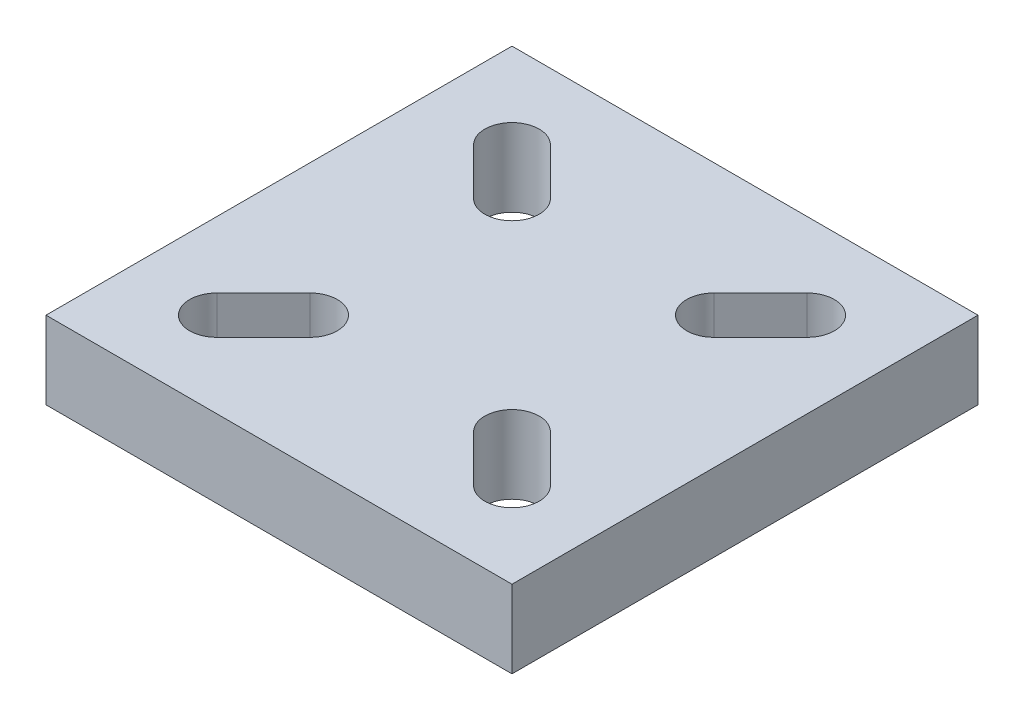
ISO-10303-21;
HEADER;
FILE_DESCRIPTION(('STEP AP214'),'2;1');
FILE_NAME('part.step','',(''),(''),'','','');
FILE_SCHEMA(('AUTOMOTIVE_DESIGN { 1 0 10303 214 1 1 1 1 }'));
ENDSEC;
DATA;
#1=APPLICATION_CONTEXT('core data for automotive mechanical design processes');
#2=APPLICATION_PROTOCOL_DEFINITION('international standard','automotive_design',2000,#1);
#3=PRODUCT_CONTEXT('',#1,'mechanical');
#4=PRODUCT('Part','Part','',(#3));
#5=PRODUCT_RELATED_PRODUCT_CATEGORY('part','',(#4));
#6=PRODUCT_DEFINITION_FORMATION('','',#4);
#7=PRODUCT_DEFINITION_CONTEXT('part definition',#1,'design');
#8=PRODUCT_DEFINITION('design','',#6,#7);
#9=PRODUCT_DEFINITION_SHAPE('','',#8);
#10=(LENGTH_UNIT() NAMED_UNIT(*) SI_UNIT(.MILLI.,.METRE.));
#11=(NAMED_UNIT(*) PLANE_ANGLE_UNIT() SI_UNIT($,.RADIAN.));
#12=(NAMED_UNIT(*) SI_UNIT($,.STERADIAN.) SOLID_ANGLE_UNIT());
#13=UNCERTAINTY_MEASURE_WITH_UNIT(LENGTH_MEASURE(1.E-05),#10,'distance_accuracy_value','');
#14=(GEOMETRIC_REPRESENTATION_CONTEXT(3) GLOBAL_UNCERTAINTY_ASSIGNED_CONTEXT((#13)) GLOBAL_UNIT_ASSIGNED_CONTEXT((#10,
#11,#12)) REPRESENTATION_CONTEXT('',''));
#15=CARTESIAN_POINT('',(0.,0.,0.));
#16=DIRECTION('',(0.,0.,1.));
#17=DIRECTION('',(1.,0.,0.));
#18=AXIS2_PLACEMENT_3D('',#15,#16,#17);
#19=CARTESIAN_POINT('',(30.,10.,-30.));
#20=DIRECTION('',(1.,0.,0.));
#21=DIRECTION('',(0.,0.,-1.));
#22=AXIS2_PLACEMENT_3D('',#19,#20,#21);
#23=PLANE('',#22);
#24=DIRECTION('',(0.,0.,1.));
#25=VECTOR('',#24,1.);
#26=CARTESIAN_POINT('',(30.,0.,-30.));
#27=LINE('',#26,#25);
#28=CARTESIAN_POINT('',(30.,0.,-30.));
#29=VERTEX_POINT('',#28);
#30=CARTESIAN_POINT('',(30.,0.,30.));
#31=VERTEX_POINT('',#30);
#32=EDGE_CURVE('E299',#29,#31,#27,.T.);
#33=ORIENTED_EDGE('',*,*,#32,.F.);
#34=DIRECTION('',(0.,-1.,0.));
#35=VECTOR('',#34,1.);
#36=CARTESIAN_POINT('',(30.,10.,-30.));
#37=LINE('',#36,#35);
#38=CARTESIAN_POINT('',(30.,10.,-30.));
#39=VERTEX_POINT('',#38);
#40=EDGE_CURVE('E11',#39,#29,#37,.T.);
#41=ORIENTED_EDGE('',*,*,#40,.F.);
#42=DIRECTION('',(0.,0.,1.));
#43=VECTOR('',#42,1.);
#44=CARTESIAN_POINT('',(30.,10.,-30.));
#45=LINE('',#44,#43);
#46=CARTESIAN_POINT('',(30.,10.,30.));
#47=VERTEX_POINT('',#46);
#48=EDGE_CURVE('E306',#39,#47,#45,.T.);
#49=ORIENTED_EDGE('',*,*,#48,.T.);
#50=DIRECTION('',(0.,-1.,0.));
#51=VECTOR('',#50,1.);
#52=CARTESIAN_POINT('',(30.,10.,30.));
#53=LINE('',#52,#51);
#54=EDGE_CURVE('E36',#47,#31,#53,.T.);
#55=ORIENTED_EDGE('',*,*,#54,.T.);
#56=EDGE_LOOP('',(#33,#41,#49,#55));
#57=FACE_BOUND('',#56,.T.);
#58=ADVANCED_FACE('F33',(#57),#23,.T.);
#59=CARTESIAN_POINT('',(30.,10.,-30.));
#60=DIRECTION('',(0.,0.,1.));
#61=DIRECTION('',(1.,0.,0.));
#62=AXIS2_PLACEMENT_3D('',#59,#60,#61);
#63=PLANE('',#62);
#64=DIRECTION('',(-1.,0.,0.));
#65=VECTOR('',#64,1.);
#66=CARTESIAN_POINT('',(30.,0.,-30.));
#67=LINE('',#66,#65);
#68=CARTESIAN_POINT('',(-30.,0.,-30.));
#69=VERTEX_POINT('',#68);
#70=EDGE_CURVE('E310',#29,#69,#67,.T.);
#71=ORIENTED_EDGE('',*,*,#70,.T.);
#72=DIRECTION('',(0.,-1.,0.));
#73=VECTOR('',#72,1.);
#74=CARTESIAN_POINT('',(-30.,10.,-30.));
#75=LINE('',#74,#73);
#76=CARTESIAN_POINT('',(-30.,10.,-30.));
#77=VERTEX_POINT('',#76);
#78=EDGE_CURVE('E41',#77,#69,#75,.T.);
#79=ORIENTED_EDGE('',*,*,#78,.F.);
#80=DIRECTION('',(-1.,0.,0.));
#81=VECTOR('',#80,1.);
#82=CARTESIAN_POINT('',(30.,10.,-30.));
#83=LINE('',#82,#81);
#84=EDGE_CURVE('E315',#39,#77,#83,.T.);
#85=ORIENTED_EDGE('',*,*,#84,.F.);
#86=ORIENTED_EDGE('',*,*,#40,.T.);
#87=EDGE_LOOP('',(#71,#79,#85,#86));
#88=FACE_BOUND('',#87,.T.);
#89=ADVANCED_FACE('F341',(#88),#63,.F.);
#90=CARTESIAN_POINT('',(-30.,10.,-30.));
#91=DIRECTION('',(1.,0.,0.));
#92=DIRECTION('',(0.,0.,-1.));
#93=AXIS2_PLACEMENT_3D('',#90,#91,#92);
#94=PLANE('',#93);
#95=DIRECTION('',(0.,0.,1.));
#96=VECTOR('',#95,1.);
#97=CARTESIAN_POINT('',(-30.,0.,-30.));
#98=LINE('',#97,#96);
#99=CARTESIAN_POINT('',(-30.,0.,30.));
#100=VERTEX_POINT('',#99);
#101=EDGE_CURVE('E322',#69,#100,#98,.T.);
#102=ORIENTED_EDGE('',*,*,#101,.T.);
#103=DIRECTION('',(0.,-1.,0.));
#104=VECTOR('',#103,1.);
#105=CARTESIAN_POINT('',(-30.,10.,30.));
#106=LINE('',#105,#104);
#107=CARTESIAN_POINT('',(-30.,10.,30.));
#108=VERTEX_POINT('',#107);
#109=EDGE_CURVE('E327',#108,#100,#106,.T.);
#110=ORIENTED_EDGE('',*,*,#109,.F.);
#111=DIRECTION('',(0.,0.,1.));
#112=VECTOR('',#111,1.);
#113=CARTESIAN_POINT('',(-30.,10.,-30.));
#114=LINE('',#113,#112);
#115=EDGE_CURVE('E313',#77,#108,#114,.T.);
#116=ORIENTED_EDGE('',*,*,#115,.F.);
#117=ORIENTED_EDGE('',*,*,#78,.T.);
#118=EDGE_LOOP('',(#102,#110,#116,#117));
#119=FACE_BOUND('',#118,.T.);
#120=ADVANCED_FACE('F345',(#119),#94,.F.);
#121=CARTESIAN_POINT('',(30.,10.,30.));
#122=DIRECTION('',(0.,0.,1.));
#123=DIRECTION('',(1.,0.,0.));
#124=AXIS2_PLACEMENT_3D('',#121,#122,#123);
#125=PLANE('',#124);
#126=DIRECTION('',(-1.,0.,0.));
#127=VECTOR('',#126,1.);
#128=CARTESIAN_POINT('',(30.,0.,30.));
#129=LINE('',#128,#127);
#130=EDGE_CURVE('E319',#31,#100,#129,.T.);
#131=ORIENTED_EDGE('',*,*,#130,.F.);
#132=ORIENTED_EDGE('',*,*,#54,.F.);
#133=DIRECTION('',(-1.,0.,0.));
#134=VECTOR('',#133,1.);
#135=CARTESIAN_POINT('',(30.,10.,30.));
#136=LINE('',#135,#134);
#137=EDGE_CURVE('E309',#47,#108,#136,.T.);
#138=ORIENTED_EDGE('',*,*,#137,.T.);
#139=ORIENTED_EDGE('',*,*,#109,.T.);
#140=EDGE_LOOP('',(#131,#132,#138,#139));
#141=FACE_BOUND('',#140,.T.);
#142=ADVANCED_FACE('F335',(#141),#125,.T.);
#143=CARTESIAN_POINT('',(0.,10.,0.));
#144=DIRECTION('',(0.,-1.,0.));
#145=DIRECTION('',(0.,0.,-1.));
#146=AXIS2_PLACEMENT_3D('',#143,#144,#145);
#147=PLANE('',#146);
#148=DIRECTION('',(0.707106781186543,0.,-0.707106781186552));
#149=VECTOR('',#148,1.);
#150=CARTESIAN_POINT('',(-16.5251262658468,10.,21.4748737341529));
#151=LINE('',#150,#149);
#152=CARTESIAN_POINT('',(-16.5251262658468,10.,21.4748737341529));
#153=VERTEX_POINT('',#152);
#154=CARTESIAN_POINT('',(-10.5251262658469,10.,15.4748737341529));
#155=VERTEX_POINT('',#154);
#156=EDGE_CURVE('E260',#153,#155,#151,.T.);
#157=ORIENTED_EDGE('',*,*,#156,.F.);
#158=CARTESIAN_POINT('',(-18.9999999999998,10.,19.));
#159=DIRECTION('',(0.,1.,0.));
#160=DIRECTION('',(0.,0.,1.));
#161=AXIS2_PLACEMENT_3D('',#158,#159,#160);
#162=CIRCLE('',#161,3.50000000000001);
#163=CARTESIAN_POINT('',(-21.4748737341527,10.,16.5251262658471));
#164=VERTEX_POINT('',#163);
#165=EDGE_CURVE('E49',#164,#153,#162,.T.);
#166=ORIENTED_EDGE('',*,*,#165,.F.);
#167=DIRECTION('',(-0.707106781186543,0.,0.707106781186552));
#168=VECTOR('',#167,1.);
#169=CARTESIAN_POINT('',(-21.4748737341527,10.,16.5251262658471));
#170=LINE('',#169,#168);
#171=CARTESIAN_POINT('',(-15.4748737341528,10.,10.5251262658471));
#172=VERTEX_POINT('',#171);
#173=EDGE_CURVE('E249',#172,#164,#170,.T.);
#174=ORIENTED_EDGE('',*,*,#173,.F.);
#175=CARTESIAN_POINT('',(-12.9999999999998,10.,13.));
#176=DIRECTION('',(0.,1.,0.));
#177=DIRECTION('',(0.,0.,1.));
#178=AXIS2_PLACEMENT_3D('',#175,#176,#177);
#179=CIRCLE('',#178,3.50000000000001);
#180=EDGE_CURVE('E263',#155,#172,#179,.T.);
#181=ORIENTED_EDGE('',*,*,#180,.F.);
#182=EDGE_LOOP('',(#157,#166,#174,#181));
#183=FACE_BOUND('',#182,.T.);
#184=DIRECTION('',(-0.707106781186551,0.,-0.707106781186544));
#185=VECTOR('',#184,1.);
#186=CARTESIAN_POINT('',(21.4748737341529,10.,16.5251262658469));
#187=LINE('',#186,#185);
#188=CARTESIAN_POINT('',(21.4748737341529,10.,16.5251262658469));
#189=VERTEX_POINT('',#188);
#190=CARTESIAN_POINT('',(15.4748737341529,10.,10.5251262658469));
#191=VERTEX_POINT('',#190);
#192=EDGE_CURVE('E230',#189,#191,#187,.T.);
#193=ORIENTED_EDGE('',*,*,#192,.F.);
#194=CARTESIAN_POINT('',(19.,10.,18.9999999999998));
#195=DIRECTION('',(0.,1.,0.));
#196=DIRECTION('',(0.,0.,1.));
#197=AXIS2_PLACEMENT_3D('',#194,#195,#196);
#198=CIRCLE('',#197,3.5);
#199=CARTESIAN_POINT('',(16.5251262658471,10.,21.4748737341527));
#200=VERTEX_POINT('',#199);
#201=EDGE_CURVE('E57',#200,#189,#198,.T.);
#202=ORIENTED_EDGE('',*,*,#201,.F.);
#203=DIRECTION('',(0.707106781186552,0.,0.707106781186543));
#204=VECTOR('',#203,1.);
#205=CARTESIAN_POINT('',(16.5251262658471,10.,21.4748737341527));
#206=LINE('',#205,#204);
#207=CARTESIAN_POINT('',(10.5251262658471,10.,15.4748737341528));
#208=VERTEX_POINT('',#207);
#209=EDGE_CURVE('E219',#208,#200,#206,.T.);
#210=ORIENTED_EDGE('',*,*,#209,.F.);
#211=CARTESIAN_POINT('',(13.,10.,12.9999999999998));
#212=DIRECTION('',(0.,1.,0.));
#213=DIRECTION('',(0.,0.,1.));
#214=AXIS2_PLACEMENT_3D('',#211,#212,#213);
#215=CIRCLE('',#214,3.5);
#216=EDGE_CURVE('E234',#191,#208,#215,.T.);
#217=ORIENTED_EDGE('',*,*,#216,.F.);
#218=EDGE_LOOP('',(#193,#202,#210,#217));
#219=FACE_BOUND('',#218,.T.);
#220=DIRECTION('',(-0.707106781186543,0.,0.707106781186552));
#221=VECTOR('',#220,1.);
#222=CARTESIAN_POINT('',(16.5251262658468,10.,-21.4748737341529));
#223=LINE('',#222,#221);
#224=CARTESIAN_POINT('',(16.5251262658468,10.,-21.4748737341529));
#225=VERTEX_POINT('',#224);
#226=CARTESIAN_POINT('',(10.5251262658469,10.,-15.4748737341529));
#227=VERTEX_POINT('',#226);
#228=EDGE_CURVE('E204',#225,#227,#223,.T.);
#229=ORIENTED_EDGE('',*,*,#228,.F.);
#230=CARTESIAN_POINT('',(18.9999999999998,10.,-19.));
#231=DIRECTION('',(0.,1.,0.));
#232=DIRECTION('',(0.,0.,1.));
#233=AXIS2_PLACEMENT_3D('',#230,#231,#232);
#234=CIRCLE('',#233,3.50000000000001);
#235=CARTESIAN_POINT('',(21.4748737341527,10.,-16.5251262658471));
#236=VERTEX_POINT('',#235);
#237=EDGE_CURVE('E177',#236,#225,#234,.T.);
#238=ORIENTED_EDGE('',*,*,#237,.F.);
#239=DIRECTION('',(0.707106781186543,0.,-0.707106781186552));
#240=VECTOR('',#239,1.);
#241=CARTESIAN_POINT('',(21.4748737341527,10.,-16.5251262658471));
#242=LINE('',#241,#240);
#243=CARTESIAN_POINT('',(15.4748737341528,10.,-10.5251262658471));
#244=VERTEX_POINT('',#243);
#245=EDGE_CURVE('E195',#244,#236,#242,.T.);
#246=ORIENTED_EDGE('',*,*,#245,.F.);
#247=CARTESIAN_POINT('',(12.9999999999998,10.,-13.));
#248=DIRECTION('',(0.,1.,0.));
#249=DIRECTION('',(0.,0.,1.));
#250=AXIS2_PLACEMENT_3D('',#247,#248,#249);
#251=CIRCLE('',#250,3.50000000000001);
#252=EDGE_CURVE('E198',#227,#244,#251,.T.);
#253=ORIENTED_EDGE('',*,*,#252,.F.);
#254=EDGE_LOOP('',(#229,#238,#246,#253));
#255=FACE_BOUND('',#254,.T.);
#256=DIRECTION('',(0.707106781186552,0.,0.707106781186543));
#257=VECTOR('',#256,1.);
#258=CARTESIAN_POINT('',(-21.4748737341529,10.,-16.5251262658468));
#259=LINE('',#258,#257);
#260=CARTESIAN_POINT('',(-21.4748737341529,10.,-16.5251262658468));
#261=VERTEX_POINT('',#260);
#262=CARTESIAN_POINT('',(-15.4748737341529,10.,-10.5251262658469));
#263=VERTEX_POINT('',#262);
#264=EDGE_CURVE('E289',#261,#263,#259,.T.);
#265=ORIENTED_EDGE('',*,*,#264,.F.);
#266=CARTESIAN_POINT('',(-19.,10.,-18.9999999999998));
#267=DIRECTION('',(0.,1.,0.));
#268=DIRECTION('',(0.,0.,1.));
#269=AXIS2_PLACEMENT_3D('',#266,#267,#268);
#270=CIRCLE('',#269,3.50000000000001);
#271=CARTESIAN_POINT('',(-16.5251262658471,10.,-21.4748737341527));
#272=VERTEX_POINT('',#271);
#273=EDGE_CURVE('E211',#272,#261,#270,.T.);
#274=ORIENTED_EDGE('',*,*,#273,.F.);
#275=DIRECTION('',(-0.707106781186551,0.,-0.707106781186544));
#276=VECTOR('',#275,1.);
#277=CARTESIAN_POINT('',(-16.5251262658471,10.,-21.4748737341527));
#278=LINE('',#277,#276);
#279=CARTESIAN_POINT('',(-10.5251262658471,10.,-15.4748737341528));
#280=VERTEX_POINT('',#279);
#281=EDGE_CURVE('E278',#280,#272,#278,.T.);
#282=ORIENTED_EDGE('',*,*,#281,.F.);
#283=CARTESIAN_POINT('',(-13.,10.,-12.9999999999999));
#284=DIRECTION('',(0.,1.,0.));
#285=DIRECTION('',(0.,0.,1.));
#286=AXIS2_PLACEMENT_3D('',#283,#284,#285);
#287=CIRCLE('',#286,3.5);
#288=EDGE_CURVE('E292',#263,#280,#287,.T.);
#289=ORIENTED_EDGE('',*,*,#288,.F.);
#290=EDGE_LOOP('',(#265,#274,#282,#289));
#291=FACE_BOUND('',#290,.T.);
#292=ORIENTED_EDGE('',*,*,#48,.F.);
#293=ORIENTED_EDGE('',*,*,#84,.T.);
#294=ORIENTED_EDGE('',*,*,#115,.T.);
#295=ORIENTED_EDGE('',*,*,#137,.F.);
#296=EDGE_LOOP('',(#292,#293,#294,#295));
#297=FACE_BOUND('',#296,.T.);
#298=ADVANCED_FACE('F347',(#183,#219,#255,#291,#297),#147,.F.);
#299=CARTESIAN_POINT('',(0.,0.,0.));
#300=DIRECTION('',(0.,-1.,0.));
#301=DIRECTION('',(0.,0.,-1.));
#302=AXIS2_PLACEMENT_3D('',#299,#300,#301);
#303=PLANE('',#302);
#304=CARTESIAN_POINT('',(-18.9999999999998,0.,19.));
#305=DIRECTION('',(0.,1.,0.));
#306=DIRECTION('',(0.,0.,1.));
#307=AXIS2_PLACEMENT_3D('',#304,#305,#306);
#308=CIRCLE('',#307,3.50000000000001);
#309=CARTESIAN_POINT('',(-21.4748737341527,0.,16.5251262658471));
#310=VERTEX_POINT('',#309);
#311=CARTESIAN_POINT('',(-16.5251262658468,0.,21.4748737341529));
#312=VERTEX_POINT('',#311);
#313=EDGE_CURVE('E245',#310,#312,#308,.T.);
#314=ORIENTED_EDGE('',*,*,#313,.T.);
#315=DIRECTION('',(0.707106781186543,0.,-0.707106781186552));
#316=VECTOR('',#315,1.);
#317=CARTESIAN_POINT('',(-16.5251262658468,0.,21.4748737341529));
#318=LINE('',#317,#316);
#319=CARTESIAN_POINT('',(-10.5251262658469,0.,15.4748737341529));
#320=VERTEX_POINT('',#319);
#321=EDGE_CURVE('E248',#312,#320,#318,.T.);
#322=ORIENTED_EDGE('',*,*,#321,.T.);
#323=CARTESIAN_POINT('',(-12.9999999999998,0.,13.));
#324=DIRECTION('',(0.,1.,0.));
#325=DIRECTION('',(0.,0.,1.));
#326=AXIS2_PLACEMENT_3D('',#323,#324,#325);
#327=CIRCLE('',#326,3.50000000000001);
#328=CARTESIAN_POINT('',(-15.4748737341528,0.,10.5251262658471));
#329=VERTEX_POINT('',#328);
#330=EDGE_CURVE('E252',#320,#329,#327,.T.);
#331=ORIENTED_EDGE('',*,*,#330,.T.);
#332=DIRECTION('',(-0.707106781186543,0.,0.707106781186552));
#333=VECTOR('',#332,1.);
#334=CARTESIAN_POINT('',(-21.4748737341527,0.,16.5251262658471));
#335=LINE('',#334,#333);
#336=EDGE_CURVE('E255',#329,#310,#335,.T.);
#337=ORIENTED_EDGE('',*,*,#336,.T.);
#338=EDGE_LOOP('',(#314,#322,#331,#337));
#339=FACE_BOUND('',#338,.T.);
#340=CARTESIAN_POINT('',(19.,0.,18.9999999999998));
#341=DIRECTION('',(0.,1.,0.));
#342=DIRECTION('',(0.,0.,1.));
#343=AXIS2_PLACEMENT_3D('',#340,#341,#342);
#344=CIRCLE('',#343,3.5);
#345=CARTESIAN_POINT('',(16.5251262658471,0.,21.4748737341527));
#346=VERTEX_POINT('',#345);
#347=CARTESIAN_POINT('',(21.4748737341529,0.,16.5251262658469));
#348=VERTEX_POINT('',#347);
#349=EDGE_CURVE('E215',#346,#348,#344,.T.);
#350=ORIENTED_EDGE('',*,*,#349,.T.);
#351=DIRECTION('',(-0.707106781186551,0.,-0.707106781186544));
#352=VECTOR('',#351,1.);
#353=CARTESIAN_POINT('',(21.4748737341529,0.,16.5251262658469));
#354=LINE('',#353,#352);
#355=CARTESIAN_POINT('',(15.4748737341529,0.,10.5251262658469));
#356=VERTEX_POINT('',#355);
#357=EDGE_CURVE('E218',#348,#356,#354,.T.);
#358=ORIENTED_EDGE('',*,*,#357,.T.);
#359=CARTESIAN_POINT('',(13.,0.,12.9999999999998));
#360=DIRECTION('',(0.,1.,0.));
#361=DIRECTION('',(0.,0.,1.));
#362=AXIS2_PLACEMENT_3D('',#359,#360,#361);
#363=CIRCLE('',#362,3.5);
#364=CARTESIAN_POINT('',(10.5251262658471,0.,15.4748737341528));
#365=VERTEX_POINT('',#364);
#366=EDGE_CURVE('E222',#356,#365,#363,.T.);
#367=ORIENTED_EDGE('',*,*,#366,.T.);
#368=DIRECTION('',(0.707106781186552,0.,0.707106781186543));
#369=VECTOR('',#368,1.);
#370=CARTESIAN_POINT('',(16.5251262658471,0.,21.4748737341527));
#371=LINE('',#370,#369);
#372=EDGE_CURVE('E225',#365,#346,#371,.T.);
#373=ORIENTED_EDGE('',*,*,#372,.T.);
#374=EDGE_LOOP('',(#350,#358,#367,#373));
#375=FACE_BOUND('',#374,.T.);
#376=CARTESIAN_POINT('',(18.9999999999998,0.,-19.));
#377=DIRECTION('',(0.,1.,0.));
#378=DIRECTION('',(0.,0.,1.));
#379=AXIS2_PLACEMENT_3D('',#376,#377,#378);
#380=CIRCLE('',#379,3.50000000000001);
#381=CARTESIAN_POINT('',(21.4748737341527,0.,-16.5251262658471));
#382=VERTEX_POINT('',#381);
#383=CARTESIAN_POINT('',(16.5251262658468,0.,-21.4748737341529));
#384=VERTEX_POINT('',#383);
#385=EDGE_CURVE('E174',#382,#384,#380,.T.);
#386=ORIENTED_EDGE('',*,*,#385,.T.);
#387=DIRECTION('',(-0.707106781186543,0.,0.707106781186552));
#388=VECTOR('',#387,1.);
#389=CARTESIAN_POINT('',(16.5251262658468,0.,-21.4748737341529));
#390=LINE('',#389,#388);
#391=CARTESIAN_POINT('',(10.5251262658469,0.,-15.4748737341529));
#392=VERTEX_POINT('',#391);
#393=EDGE_CURVE('E186',#384,#392,#390,.T.);
#394=ORIENTED_EDGE('',*,*,#393,.T.);
#395=CARTESIAN_POINT('',(12.9999999999998,0.,-13.));
#396=DIRECTION('',(0.,1.,0.));
#397=DIRECTION('',(0.,0.,1.));
#398=AXIS2_PLACEMENT_3D('',#395,#396,#397);
#399=CIRCLE('',#398,3.50000000000001);
#400=CARTESIAN_POINT('',(15.4748737341528,0.,-10.5251262658471));
#401=VERTEX_POINT('',#400);
#402=EDGE_CURVE('E190',#392,#401,#399,.T.);
#403=ORIENTED_EDGE('',*,*,#402,.T.);
#404=DIRECTION('',(0.707106781186543,0.,-0.707106781186552));
#405=VECTOR('',#404,1.);
#406=CARTESIAN_POINT('',(21.4748737341527,0.,-16.5251262658471));
#407=LINE('',#406,#405);
#408=EDGE_CURVE('E182',#401,#382,#407,.T.);
#409=ORIENTED_EDGE('',*,*,#408,.T.);
#410=EDGE_LOOP('',(#386,#394,#403,#409));
#411=FACE_BOUND('',#410,.T.);
#412=CARTESIAN_POINT('',(-19.,0.,-18.9999999999998));
#413=DIRECTION('',(0.,1.,0.));
#414=DIRECTION('',(0.,0.,1.));
#415=AXIS2_PLACEMENT_3D('',#412,#413,#414);
#416=CIRCLE('',#415,3.50000000000001);
#417=CARTESIAN_POINT('',(-16.5251262658471,0.,-21.4748737341527));
#418=VERTEX_POINT('',#417);
#419=CARTESIAN_POINT('',(-21.4748737341529,0.,-16.5251262658468));
#420=VERTEX_POINT('',#419);
#421=EDGE_CURVE('E274',#418,#420,#416,.T.);
#422=ORIENTED_EDGE('',*,*,#421,.T.);
#423=DIRECTION('',(0.707106781186552,0.,0.707106781186543));
#424=VECTOR('',#423,1.);
#425=CARTESIAN_POINT('',(-21.4748737341529,0.,-16.5251262658468));
#426=LINE('',#425,#424);
#427=CARTESIAN_POINT('',(-15.4748737341529,0.,-10.5251262658469));
#428=VERTEX_POINT('',#427);
#429=EDGE_CURVE('E277',#420,#428,#426,.T.);
#430=ORIENTED_EDGE('',*,*,#429,.T.);
#431=CARTESIAN_POINT('',(-13.,0.,-12.9999999999999));
#432=DIRECTION('',(0.,1.,0.));
#433=DIRECTION('',(0.,0.,1.));
#434=AXIS2_PLACEMENT_3D('',#431,#432,#433);
#435=CIRCLE('',#434,3.5);
#436=CARTESIAN_POINT('',(-10.5251262658471,0.,-15.4748737341528));
#437=VERTEX_POINT('',#436);
#438=EDGE_CURVE('E281',#428,#437,#435,.T.);
#439=ORIENTED_EDGE('',*,*,#438,.T.);
#440=DIRECTION('',(-0.707106781186551,0.,-0.707106781186544));
#441=VECTOR('',#440,1.);
#442=CARTESIAN_POINT('',(-16.5251262658471,0.,-21.4748737341527));
#443=LINE('',#442,#441);
#444=EDGE_CURVE('E284',#437,#418,#443,.T.);
#445=ORIENTED_EDGE('',*,*,#444,.T.);
#446=EDGE_LOOP('',(#422,#430,#439,#445));
#447=FACE_BOUND('',#446,.T.);
#448=ORIENTED_EDGE('',*,*,#32,.T.);
#449=ORIENTED_EDGE('',*,*,#130,.T.);
#450=ORIENTED_EDGE('',*,*,#101,.F.);
#451=ORIENTED_EDGE('',*,*,#70,.F.);
#452=EDGE_LOOP('',(#448,#449,#450,#451));
#453=FACE_BOUND('',#452,.T.);
#454=ADVANCED_FACE('F192',(#339,#375,#411,#447,#453),#303,.T.);
#455=CARTESIAN_POINT('',(-19.,0.,-18.9999999999998));
#456=DIRECTION('',(0.,1.,0.));
#457=DIRECTION('',(0.,0.,1.));
#458=AXIS2_PLACEMENT_3D('',#455,#456,#457);
#459=CYLINDRICAL_SURFACE('',#458,3.50000000000001);
#460=ORIENTED_EDGE('',*,*,#273,.T.);
#461=DIRECTION('',(0.,1.,0.));
#462=VECTOR('',#461,1.);
#463=CARTESIAN_POINT('',(-21.4748737341529,0.,-16.5251262658468));
#464=LINE('',#463,#462);
#465=EDGE_CURVE('E287',#420,#261,#464,.T.);
#466=ORIENTED_EDGE('',*,*,#465,.F.);
#467=ORIENTED_EDGE('',*,*,#421,.F.);
#468=DIRECTION('',(0.,1.,0.));
#469=VECTOR('',#468,1.);
#470=CARTESIAN_POINT('',(-16.5251262658471,0.,-21.4748737341527));
#471=LINE('',#470,#469);
#472=EDGE_CURVE('E297',#418,#272,#471,.T.);
#473=ORIENTED_EDGE('',*,*,#472,.T.);
#474=EDGE_LOOP('',(#460,#466,#467,#473));
#475=FACE_BOUND('',#474,.T.);
#476=ADVANCED_FACE('F355',(#475),#459,.F.);
#477=CARTESIAN_POINT('',(-16.5251262658471,0.,-21.4748737341527));
#478=DIRECTION('',(0.707106781186544,0.,-0.707106781186551));
#479=DIRECTION('',(-0.707106781186551,0.,-0.707106781186544));
#480=AXIS2_PLACEMENT_3D('',#477,#478,#479);
#481=PLANE('',#480);
#482=ORIENTED_EDGE('',*,*,#281,.T.);
#483=ORIENTED_EDGE('',*,*,#472,.F.);
#484=ORIENTED_EDGE('',*,*,#444,.F.);
#485=DIRECTION('',(0.,1.,0.));
#486=VECTOR('',#485,1.);
#487=CARTESIAN_POINT('',(-10.5251262658471,0.,-15.4748737341528));
#488=LINE('',#487,#486);
#489=EDGE_CURVE('E300',#437,#280,#488,.T.);
#490=ORIENTED_EDGE('',*,*,#489,.T.);
#491=EDGE_LOOP('',(#482,#483,#484,#490));
#492=FACE_BOUND('',#491,.T.);
#493=ADVANCED_FACE('F395',(#492),#481,.F.);
#494=CARTESIAN_POINT('',(-13.,0.,-12.9999999999999));
#495=DIRECTION('',(0.,1.,0.));
#496=DIRECTION('',(0.,0.,1.));
#497=AXIS2_PLACEMENT_3D('',#494,#495,#496);
#498=CYLINDRICAL_SURFACE('',#497,3.5);
#499=ORIENTED_EDGE('',*,*,#288,.T.);
#500=ORIENTED_EDGE('',*,*,#489,.F.);
#501=ORIENTED_EDGE('',*,*,#438,.F.);
#502=DIRECTION('',(0.,1.,0.));
#503=VECTOR('',#502,1.);
#504=CARTESIAN_POINT('',(-15.4748737341529,0.,-10.5251262658469));
#505=LINE('',#504,#503);
#506=EDGE_CURVE('E302',#428,#263,#505,.T.);
#507=ORIENTED_EDGE('',*,*,#506,.T.);
#508=EDGE_LOOP('',(#499,#500,#501,#507));
#509=FACE_BOUND('',#508,.T.);
#510=ADVANCED_FACE('F404',(#509),#498,.F.);
#511=CARTESIAN_POINT('',(-21.4748737341529,0.,-16.5251262658468));
#512=DIRECTION('',(-0.707106781186543,0.,0.707106781186552));
#513=DIRECTION('',(0.707106781186552,0.,0.707106781186543));
#514=AXIS2_PLACEMENT_3D('',#511,#512,#513);
#515=PLANE('',#514);
#516=ORIENTED_EDGE('',*,*,#264,.T.);
#517=ORIENTED_EDGE('',*,*,#506,.F.);
#518=ORIENTED_EDGE('',*,*,#429,.F.);
#519=ORIENTED_EDGE('',*,*,#465,.T.);
#520=EDGE_LOOP('',(#516,#517,#518,#519));
#521=FACE_BOUND('',#520,.T.);
#522=ADVANCED_FACE('F414',(#521),#515,.F.);
#523=CARTESIAN_POINT('',(18.9999999999998,0.,-19.));
#524=DIRECTION('',(0.,1.,0.));
#525=DIRECTION('',(0.,0.,1.));
#526=AXIS2_PLACEMENT_3D('',#523,#524,#525);
#527=CYLINDRICAL_SURFACE('',#526,3.50000000000001);
#528=ORIENTED_EDGE('',*,*,#237,.T.);
#529=DIRECTION('',(0.,1.,0.));
#530=VECTOR('',#529,1.);
#531=CARTESIAN_POINT('',(16.5251262658468,0.,-21.4748737341529));
#532=LINE('',#531,#530);
#533=EDGE_CURVE('E170',#384,#225,#532,.T.);
#534=ORIENTED_EDGE('',*,*,#533,.F.);
#535=ORIENTED_EDGE('',*,*,#385,.F.);
#536=DIRECTION('',(0.,1.,0.));
#537=VECTOR('',#536,1.);
#538=CARTESIAN_POINT('',(21.4748737341527,0.,-16.5251262658471));
#539=LINE('',#538,#537);
#540=EDGE_CURVE('E209',#382,#236,#539,.T.);
#541=ORIENTED_EDGE('',*,*,#540,.T.);
#542=EDGE_LOOP('',(#528,#534,#535,#541));
#543=FACE_BOUND('',#542,.T.);
#544=ADVANCED_FACE('F172',(#543),#527,.F.);
#545=CARTESIAN_POINT('',(21.4748737341527,0.,-16.5251262658471));
#546=DIRECTION('',(0.707106781186552,0.,0.707106781186543));
#547=DIRECTION('',(0.707106781186543,0.,-0.707106781186552));
#548=AXIS2_PLACEMENT_3D('',#545,#546,#547);
#549=PLANE('',#548);
#550=ORIENTED_EDGE('',*,*,#245,.T.);
#551=ORIENTED_EDGE('',*,*,#540,.F.);
#552=ORIENTED_EDGE('',*,*,#408,.F.);
#553=DIRECTION('',(0.,1.,0.));
#554=VECTOR('',#553,1.);
#555=CARTESIAN_POINT('',(15.4748737341528,0.,-10.5251262658471));
#556=LINE('',#555,#554);
#557=EDGE_CURVE('E212',#401,#244,#556,.T.);
#558=ORIENTED_EDGE('',*,*,#557,.T.);
#559=EDGE_LOOP('',(#550,#551,#552,#558));
#560=FACE_BOUND('',#559,.T.);
#561=ADVANCED_FACE('F433',(#560),#549,.F.);
#562=CARTESIAN_POINT('',(12.9999999999998,0.,-13.));
#563=DIRECTION('',(0.,1.,0.));
#564=DIRECTION('',(0.,0.,1.));
#565=AXIS2_PLACEMENT_3D('',#562,#563,#564);
#566=CYLINDRICAL_SURFACE('',#565,3.50000000000001);
#567=ORIENTED_EDGE('',*,*,#252,.T.);
#568=ORIENTED_EDGE('',*,*,#557,.F.);
#569=ORIENTED_EDGE('',*,*,#402,.F.);
#570=DIRECTION('',(0.,1.,0.));
#571=VECTOR('',#570,1.);
#572=CARTESIAN_POINT('',(10.5251262658469,0.,-15.4748737341529));
#573=LINE('',#572,#571);
#574=EDGE_CURVE('E181',#392,#227,#573,.T.);
#575=ORIENTED_EDGE('',*,*,#574,.T.);
#576=EDGE_LOOP('',(#567,#568,#569,#575));
#577=FACE_BOUND('',#576,.T.);
#578=ADVANCED_FACE('F442',(#577),#566,.F.);
#579=CARTESIAN_POINT('',(16.5251262658468,0.,-21.4748737341529));
#580=DIRECTION('',(-0.707106781186552,0.,-0.707106781186543));
#581=DIRECTION('',(-0.707106781186543,0.,0.707106781186552));
#582=AXIS2_PLACEMENT_3D('',#579,#580,#581);
#583=PLANE('',#582);
#584=ORIENTED_EDGE('',*,*,#228,.T.);
#585=ORIENTED_EDGE('',*,*,#574,.F.);
#586=ORIENTED_EDGE('',*,*,#393,.F.);
#587=ORIENTED_EDGE('',*,*,#533,.T.);
#588=EDGE_LOOP('',(#584,#585,#586,#587));
#589=FACE_BOUND('',#588,.T.);
#590=ADVANCED_FACE('F187',(#589),#583,.F.);
#591=CARTESIAN_POINT('',(19.,0.,18.9999999999998));
#592=DIRECTION('',(0.,1.,0.));
#593=DIRECTION('',(0.,0.,1.));
#594=AXIS2_PLACEMENT_3D('',#591,#592,#593);
#595=CYLINDRICAL_SURFACE('',#594,3.5);
#596=ORIENTED_EDGE('',*,*,#201,.T.);
#597=DIRECTION('',(0.,1.,0.));
#598=VECTOR('',#597,1.);
#599=CARTESIAN_POINT('',(21.4748737341529,0.,16.5251262658469));
#600=LINE('',#599,#598);
#601=EDGE_CURVE('E228',#348,#189,#600,.T.);
#602=ORIENTED_EDGE('',*,*,#601,.F.);
#603=ORIENTED_EDGE('',*,*,#349,.F.);
#604=DIRECTION('',(0.,1.,0.));
#605=VECTOR('',#604,1.);
#606=CARTESIAN_POINT('',(16.5251262658471,0.,21.4748737341527));
#607=LINE('',#606,#605);
#608=EDGE_CURVE('E205',#346,#200,#607,.T.);
#609=ORIENTED_EDGE('',*,*,#608,.T.);
#610=EDGE_LOOP('',(#596,#602,#603,#609));
#611=FACE_BOUND('',#610,.T.);
#612=ADVANCED_FACE('F461',(#611),#595,.F.);
#613=CARTESIAN_POINT('',(16.5251262658471,0.,21.4748737341527));
#614=DIRECTION('',(-0.707106781186543,0.,0.707106781186552));
#615=DIRECTION('',(0.707106781186552,0.,0.707106781186543));
#616=AXIS2_PLACEMENT_3D('',#613,#614,#615);
#617=PLANE('',#616);
#618=ORIENTED_EDGE('',*,*,#209,.T.);
#619=ORIENTED_EDGE('',*,*,#608,.F.);
#620=ORIENTED_EDGE('',*,*,#372,.F.);
#621=DIRECTION('',(0.,1.,0.));
#622=VECTOR('',#621,1.);
#623=CARTESIAN_POINT('',(10.5251262658471,0.,15.4748737341528));
#624=LINE('',#623,#622);
#625=EDGE_CURVE('E240',#365,#208,#624,.T.);
#626=ORIENTED_EDGE('',*,*,#625,.T.);
#627=EDGE_LOOP('',(#618,#619,#620,#626));
#628=FACE_BOUND('',#627,.T.);
#629=ADVANCED_FACE('F470',(#628),#617,.F.);
#630=CARTESIAN_POINT('',(13.,0.,12.9999999999998));
#631=DIRECTION('',(0.,1.,0.));
#632=DIRECTION('',(0.,0.,1.));
#633=AXIS2_PLACEMENT_3D('',#630,#631,#632);
#634=CYLINDRICAL_SURFACE('',#633,3.5);
#635=ORIENTED_EDGE('',*,*,#216,.T.);
#636=ORIENTED_EDGE('',*,*,#625,.F.);
#637=ORIENTED_EDGE('',*,*,#366,.F.);
#638=DIRECTION('',(0.,1.,0.));
#639=VECTOR('',#638,1.);
#640=CARTESIAN_POINT('',(15.4748737341529,0.,10.5251262658469));
#641=LINE('',#640,#639);
#642=EDGE_CURVE('E242',#356,#191,#641,.T.);
#643=ORIENTED_EDGE('',*,*,#642,.T.);
#644=EDGE_LOOP('',(#635,#636,#637,#643));
#645=FACE_BOUND('',#644,.T.);
#646=ADVANCED_FACE('F479',(#645),#634,.F.);
#647=CARTESIAN_POINT('',(21.4748737341529,0.,16.5251262658469));
#648=DIRECTION('',(0.707106781186544,0.,-0.707106781186551));
#649=DIRECTION('',(-0.707106781186551,0.,-0.707106781186544));
#650=AXIS2_PLACEMENT_3D('',#647,#648,#649);
#651=PLANE('',#650);
#652=ORIENTED_EDGE('',*,*,#192,.T.);
#653=ORIENTED_EDGE('',*,*,#642,.F.);
#654=ORIENTED_EDGE('',*,*,#357,.F.);
#655=ORIENTED_EDGE('',*,*,#601,.T.);
#656=EDGE_LOOP('',(#652,#653,#654,#655));
#657=FACE_BOUND('',#656,.T.);
#658=ADVANCED_FACE('F489',(#657),#651,.F.);
#659=CARTESIAN_POINT('',(-18.9999999999998,0.,19.));
#660=DIRECTION('',(0.,1.,0.));
#661=DIRECTION('',(0.,0.,1.));
#662=AXIS2_PLACEMENT_3D('',#659,#660,#661);
#663=CYLINDRICAL_SURFACE('',#662,3.50000000000001);
#664=ORIENTED_EDGE('',*,*,#165,.T.);
#665=DIRECTION('',(0.,1.,0.));
#666=VECTOR('',#665,1.);
#667=CARTESIAN_POINT('',(-16.5251262658468,0.,21.4748737341529));
#668=LINE('',#667,#666);
#669=EDGE_CURVE('E258',#312,#153,#668,.T.);
#670=ORIENTED_EDGE('',*,*,#669,.F.);
#671=ORIENTED_EDGE('',*,*,#313,.F.);
#672=DIRECTION('',(0.,1.,0.));
#673=VECTOR('',#672,1.);
#674=CARTESIAN_POINT('',(-21.4748737341527,0.,16.5251262658471));
#675=LINE('',#674,#673);
#676=EDGE_CURVE('E231',#310,#164,#675,.T.);
#677=ORIENTED_EDGE('',*,*,#676,.T.);
#678=EDGE_LOOP('',(#664,#670,#671,#677));
#679=FACE_BOUND('',#678,.T.);
#680=ADVANCED_FACE('F499',(#679),#663,.F.);
#681=CARTESIAN_POINT('',(-21.4748737341527,0.,16.5251262658471));
#682=DIRECTION('',(-0.707106781186552,0.,-0.707106781186543));
#683=DIRECTION('',(-0.707106781186543,0.,0.707106781186552));
#684=AXIS2_PLACEMENT_3D('',#681,#682,#683);
#685=PLANE('',#684);
#686=ORIENTED_EDGE('',*,*,#173,.T.);
#687=ORIENTED_EDGE('',*,*,#676,.F.);
#688=ORIENTED_EDGE('',*,*,#336,.F.);
#689=DIRECTION('',(0.,1.,0.));
#690=VECTOR('',#689,1.);
#691=CARTESIAN_POINT('',(-15.4748737341528,0.,10.5251262658471));
#692=LINE('',#691,#690);
#693=EDGE_CURVE('E269',#329,#172,#692,.T.);
#694=ORIENTED_EDGE('',*,*,#693,.T.);
#695=EDGE_LOOP('',(#686,#687,#688,#694));
#696=FACE_BOUND('',#695,.T.);
#697=ADVANCED_FACE('F509',(#696),#685,.F.);
#698=CARTESIAN_POINT('',(-12.9999999999998,0.,13.));
#699=DIRECTION('',(0.,1.,0.));
#700=DIRECTION('',(0.,0.,1.));
#701=AXIS2_PLACEMENT_3D('',#698,#699,#700);
#702=CYLINDRICAL_SURFACE('',#701,3.50000000000001);
#703=ORIENTED_EDGE('',*,*,#180,.T.);
#704=ORIENTED_EDGE('',*,*,#693,.F.);
#705=ORIENTED_EDGE('',*,*,#330,.F.);
#706=DIRECTION('',(0.,1.,0.));
#707=VECTOR('',#706,1.);
#708=CARTESIAN_POINT('',(-10.5251262658469,0.,15.4748737341529));
#709=LINE('',#708,#707);
#710=EDGE_CURVE('E271',#320,#155,#709,.T.);
#711=ORIENTED_EDGE('',*,*,#710,.T.);
#712=EDGE_LOOP('',(#703,#704,#705,#711));
#713=FACE_BOUND('',#712,.T.);
#714=ADVANCED_FACE('F518',(#713),#702,.F.);
#715=CARTESIAN_POINT('',(-16.5251262658468,0.,21.4748737341529));
#716=DIRECTION('',(0.707106781186552,0.,0.707106781186543));
#717=DIRECTION('',(0.707106781186543,0.,-0.707106781186552));
#718=AXIS2_PLACEMENT_3D('',#715,#716,#717);
#719=PLANE('',#718);
#720=ORIENTED_EDGE('',*,*,#156,.T.);
#721=ORIENTED_EDGE('',*,*,#710,.F.);
#722=ORIENTED_EDGE('',*,*,#321,.F.);
#723=ORIENTED_EDGE('',*,*,#669,.T.);
#724=EDGE_LOOP('',(#720,#721,#722,#723));
#725=FACE_BOUND('',#724,.T.);
#726=ADVANCED_FACE('F528',(#725),#719,.F.);
#727=CLOSED_SHELL('',(#58,#89,#120,#142,#298,#454,#476,#493,#510,#522,#544,#561,#578,#590,#612,
#629,#646,#658,#680,#697,#714,#726));
#728=MANIFOLD_SOLID_BREP('B2',#727);
#729=ADVANCED_BREP_SHAPE_REPRESENTATION('',(#18,#728),#14);
#730=SHAPE_DEFINITION_REPRESENTATION(#9,#729);
ENDSEC;
END-ISO-10303-21;
